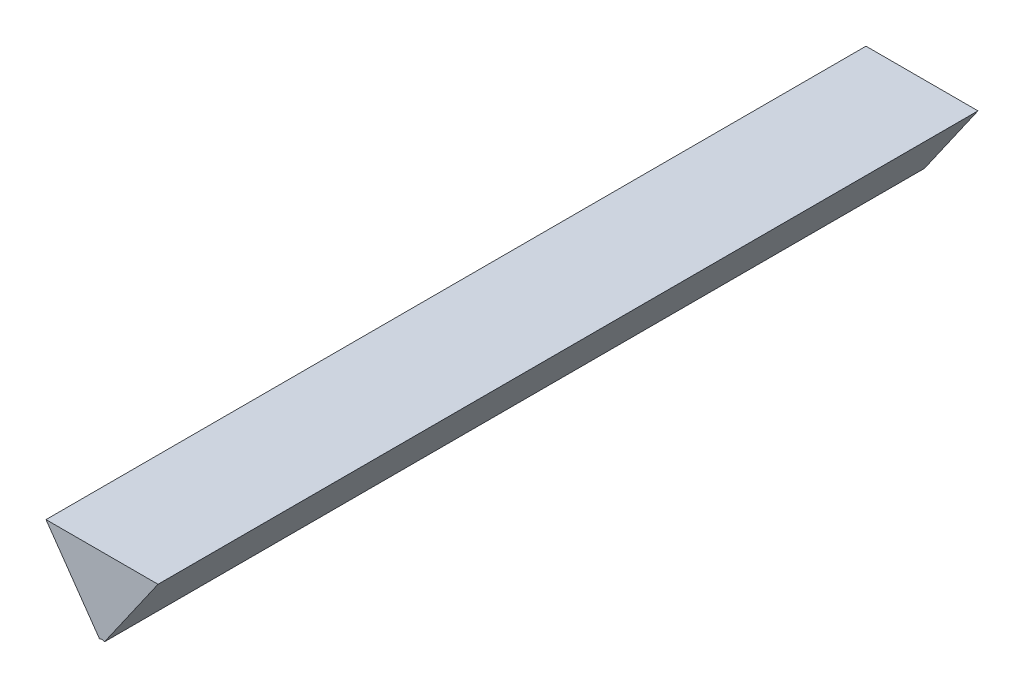
ISO-10303-21;
HEADER;
FILE_DESCRIPTION(('STEP AP214'),'2;1');
FILE_NAME('part.step','',(''),(''),'','','');
FILE_SCHEMA(('AUTOMOTIVE_DESIGN { 1 0 10303 214 1 1 1 1 }'));
ENDSEC;
DATA;
#1=APPLICATION_CONTEXT('core data for automotive mechanical design processes');
#2=APPLICATION_PROTOCOL_DEFINITION('international standard','automotive_design',2000,#1);
#3=PRODUCT_CONTEXT('',#1,'mechanical');
#4=PRODUCT('Part','Part','',(#3));
#5=PRODUCT_RELATED_PRODUCT_CATEGORY('part','',(#4));
#6=PRODUCT_DEFINITION_FORMATION('','',#4);
#7=PRODUCT_DEFINITION_CONTEXT('part definition',#1,'design');
#8=PRODUCT_DEFINITION('design','',#6,#7);
#9=PRODUCT_DEFINITION_SHAPE('','',#8);
#10=(LENGTH_UNIT() NAMED_UNIT(*) SI_UNIT(.MILLI.,.METRE.));
#11=(NAMED_UNIT(*) PLANE_ANGLE_UNIT() SI_UNIT($,.RADIAN.));
#12=(NAMED_UNIT(*) SI_UNIT($,.STERADIAN.) SOLID_ANGLE_UNIT());
#13=UNCERTAINTY_MEASURE_WITH_UNIT(LENGTH_MEASURE(1.E-05),#10,'distance_accuracy_value','');
#14=(GEOMETRIC_REPRESENTATION_CONTEXT(3) GLOBAL_UNCERTAINTY_ASSIGNED_CONTEXT((#13)) GLOBAL_UNIT_ASSIGNED_CONTEXT((#10,
#11,#12)) REPRESENTATION_CONTEXT('',''));
#15=CARTESIAN_POINT('',(0.,0.,0.));
#16=DIRECTION('',(0.,0.,1.));
#17=DIRECTION('',(1.,0.,0.));
#18=AXIS2_PLACEMENT_3D('',#15,#16,#17);
#19=CARTESIAN_POINT('',(-1.2917531991014,-0.394018118427978,0.1));
#20=DIRECTION('',(0.,0.,1.));
#21=DIRECTION('',(1.,0.,0.));
#22=AXIS2_PLACEMENT_3D('',#19,#20,#21);
#23=PLANE('',#22);
#24=DIRECTION('',(-0.59972682284893,0.800204810005243,0.));
#25=VECTOR('',#24,1.);
#26=CARTESIAN_POINT('',(-1.2941929476078,-0.40012217748513,0.1));
#27=LINE('',#26,#25);
#28=CARTESIAN_POINT('',(-1.2944928110192,-0.399722075080128,0.1));
#29=VERTEX_POINT('',#28);
#30=CARTESIAN_POINT('',(-1.301023806595,-0.390375984456348,0.1));
#31=VERTEX_POINT('',#30);
#32=EDGE_CURVE('E11',#29,#31,#27,.T.);
#33=ORIENTED_EDGE('',*,*,#32,.F.);
#34=CARTESIAN_POINT('',(-1.2941929476078,-0.40012217748513,0.1));
#35=DIRECTION('',(0.,0.,-1.));
#36=DIRECTION('',(-1.,0.,0.));
#37=AXIS2_PLACEMENT_3D('',#34,#35,#36);
#38=CIRCLE('',#37,0.0005);
#39=CARTESIAN_POINT('',(-1.2938930841964,-0.399722075080128,0.1));
#40=VERTEX_POINT('',#39);
#41=EDGE_CURVE('E24',#29,#40,#38,.T.);
#42=ORIENTED_EDGE('',*,*,#41,.T.);
#43=DIRECTION('',(0.59972682284893,0.800204810005243,0.));
#44=VECTOR('',#43,1.);
#45=CARTESIAN_POINT('',(-1.2941929476078,-0.40012217748513,0.1));
#46=LINE('',#45,#44);
#47=CARTESIAN_POINT('',(-1.2873620886206,-0.390375984456348,0.1));
#48=VERTEX_POINT('',#47);
#49=EDGE_CURVE('E182',#40,#48,#46,.T.);
#50=ORIENTED_EDGE('',*,*,#49,.T.);
#51=DIRECTION('',(-1.,0.,0.));
#52=VECTOR('',#51,1.);
#53=CARTESIAN_POINT('',(-1.2868726607526,-0.390354849213328,0.1));
#54=LINE('',#53,#52);
#55=EDGE_CURVE('E180',#48,#31,#54,.T.);
#56=ORIENTED_EDGE('',*,*,#55,.T.);
#57=EDGE_LOOP('',(#33,#42,#50,#56));
#58=FACE_BOUND('',#57,.T.);
#59=ADVANCED_FACE('F17',(#58),#23,.T.);
#60=CARTESIAN_POINT('',(-1.2868726607526,-0.390354849213328,0.));
#61=DIRECTION('',(0.,1.,0.));
#62=DIRECTION('',(-1.,0.,0.));
#63=AXIS2_PLACEMENT_3D('',#60,#61,#62);
#64=PLANE('',#63);
#65=CARTESIAN_POINT('',(-1.30101323446305,-0.390354849213328,0.));
#66=DIRECTION('',(0.,0.,1.));
#67=VECTOR('',#66,1.);
#68=LINE('',#65,#67);
#69=CARTESIAN_POINT('',(-1.301023806595,-0.390375984456348,0.));
#70=VERTEX_POINT('',#69);
#71=EDGE_CURVE('E68',#70,#31,#68,.T.);
#72=ORIENTED_EDGE('',*,*,#71,.T.);
#73=ORIENTED_EDGE('',*,*,#55,.F.);
#74=CARTESIAN_POINT('',(-1.2873726607526,-0.390354849213328,0.1));
#75=DIRECTION('',(0.,0.,-1.));
#76=VECTOR('',#75,1.);
#77=LINE('',#74,#76);
#78=CARTESIAN_POINT('',(-1.2873620886206,-0.390375984456348,0.));
#79=VERTEX_POINT('',#78);
#80=EDGE_CURVE('E86',#48,#79,#77,.T.);
#81=ORIENTED_EDGE('',*,*,#80,.T.);
#82=DIRECTION('',(-1.,0.,0.));
#83=VECTOR('',#82,1.);
#84=CARTESIAN_POINT('',(-1.2868726607526,-0.390354849213328,0.));
#85=LINE('',#84,#83);
#86=EDGE_CURVE('E82',#79,#70,#85,.T.);
#87=ORIENTED_EDGE('',*,*,#86,.T.);
#88=EDGE_LOOP('',(#72,#73,#81,#87));
#89=FACE_BOUND('',#88,.T.);
#90=ADVANCED_FACE('F102',(#89),#64,.T.);
#91=CARTESIAN_POINT('',(-1.2941929476078,-0.40012217748513,0.));
#92=DIRECTION('',(0.800204810005244,-0.59972682284893,0.));
#93=DIRECTION('',(0.59972682284893,0.800204810005244,0.));
#94=AXIS2_PLACEMENT_3D('',#91,#92,#93);
#95=PLANE('',#94);
#96=DIRECTION('',(0.,0.,-1.));
#97=VECTOR('',#96,1.);
#98=CARTESIAN_POINT('',(-1.2938930841964,-0.399722075080128,0.1));
#99=LINE('',#98,#97);
#100=CARTESIAN_POINT('',(-1.2938930841964,-0.399722075080128,0.));
#101=VERTEX_POINT('',#100);
#102=EDGE_CURVE('E80',#40,#101,#99,.T.);
#103=ORIENTED_EDGE('',*,*,#102,.T.);
#104=DIRECTION('',(0.59972682284893,0.800204810005243,0.));
#105=VECTOR('',#104,1.);
#106=CARTESIAN_POINT('',(-1.2941929476078,-0.40012217748513,0.));
#107=LINE('',#106,#105);
#108=EDGE_CURVE('E60',#101,#79,#107,.T.);
#109=ORIENTED_EDGE('',*,*,#108,.T.);
#110=ORIENTED_EDGE('',*,*,#80,.F.);
#111=ORIENTED_EDGE('',*,*,#49,.F.);
#112=EDGE_LOOP('',(#103,#109,#110,#111));
#113=FACE_BOUND('',#112,.T.);
#114=ADVANCED_FACE('F93',(#113),#95,.T.);
#115=CARTESIAN_POINT('',(-1.2917531991014,-0.394018118427978,0.));
#116=DIRECTION('',(0.,0.,1.));
#117=DIRECTION('',(1.,0.,0.));
#118=AXIS2_PLACEMENT_3D('',#115,#116,#117);
#119=PLANE('',#118);
#120=ORIENTED_EDGE('',*,*,#86,.F.);
#121=ORIENTED_EDGE('',*,*,#108,.F.);
#122=CARTESIAN_POINT('',(-1.2941929476078,-0.40012217748513,0.));
#123=DIRECTION('',(0.,0.,1.));
#124=DIRECTION('',(-1.,0.,0.));
#125=AXIS2_PLACEMENT_3D('',#122,#123,#124);
#126=CIRCLE('',#125,0.0005);
#127=CARTESIAN_POINT('',(-1.2944928110192,-0.399722075080128,0.));
#128=VERTEX_POINT('',#127);
#129=EDGE_CURVE('E54',#101,#128,#126,.T.);
#130=ORIENTED_EDGE('',*,*,#129,.T.);
#131=DIRECTION('',(-0.59972682284893,0.800204810005243,0.));
#132=VECTOR('',#131,1.);
#133=CARTESIAN_POINT('',(-1.2941929476078,-0.40012217748513,0.));
#134=LINE('',#133,#132);
#135=EDGE_CURVE('E58',#128,#70,#134,.T.);
#136=ORIENTED_EDGE('',*,*,#135,.T.);
#137=EDGE_LOOP('',(#120,#121,#130,#136));
#138=FACE_BOUND('',#137,.T.);
#139=ADVANCED_FACE('F57',(#138),#119,.F.);
#140=CARTESIAN_POINT('',(-1.2941929476078,-0.40012217748513,0.));
#141=DIRECTION('',(0.800204810005244,0.59972682284893,0.));
#142=DIRECTION('',(-0.59972682284893,0.800204810005244,0.));
#143=AXIS2_PLACEMENT_3D('',#140,#141,#142);
#144=PLANE('',#143);
#145=ORIENTED_EDGE('',*,*,#71,.F.);
#146=ORIENTED_EDGE('',*,*,#135,.F.);
#147=DIRECTION('',(0.,0.,1.));
#148=VECTOR('',#147,1.);
#149=CARTESIAN_POINT('',(-1.2944928110192,-0.399722075080128,0.1));
#150=LINE('',#149,#148);
#151=EDGE_CURVE('E66',#128,#29,#150,.T.);
#152=ORIENTED_EDGE('',*,*,#151,.T.);
#153=ORIENTED_EDGE('',*,*,#32,.T.);
#154=EDGE_LOOP('',(#145,#146,#152,#153));
#155=FACE_BOUND('',#154,.T.);
#156=ADVANCED_FACE('F65',(#155),#144,.F.);
#157=CARTESIAN_POINT('',(-1.2941929476078,-0.40012217748513,0.1));
#158=DIRECTION('',(0.,0.,1.));
#159=DIRECTION('',(-1.,0.,0.));
#160=AXIS2_PLACEMENT_3D('',#157,#158,#159);
#161=CYLINDRICAL_SURFACE('',#160,0.0005);
#162=ORIENTED_EDGE('',*,*,#102,.F.);
#163=ORIENTED_EDGE('',*,*,#41,.F.);
#164=ORIENTED_EDGE('',*,*,#151,.F.);
#165=ORIENTED_EDGE('',*,*,#129,.F.);
#166=EDGE_LOOP('',(#162,#163,#164,#165));
#167=FACE_BOUND('',#166,.T.);
#168=ADVANCED_FACE('F72',(#167),#161,.F.);
#169=CLOSED_SHELL('',(#59,#90,#114,#139,#156,#168));
#170=MANIFOLD_SOLID_BREP('B1',#169);
#171=ADVANCED_BREP_SHAPE_REPRESENTATION('',(#18,#170),#14);
#172=SHAPE_DEFINITION_REPRESENTATION(#9,#171);
ENDSEC;
END-ISO-10303-21;
